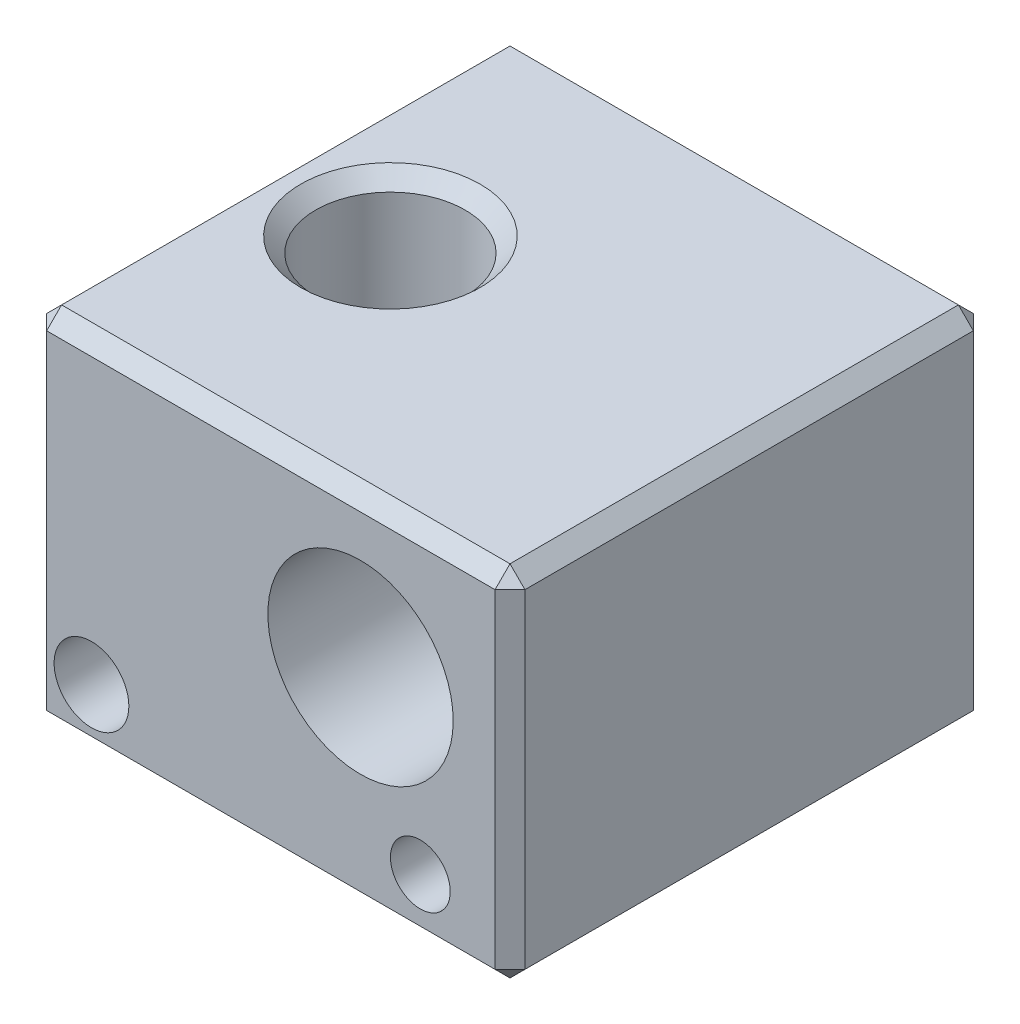
ISO-10303-21;
HEADER;
FILE_DESCRIPTION(('STEP AP214'),'2;1');
FILE_NAME('part.step','',(''),(''),'','','');
FILE_SCHEMA(('AUTOMOTIVE_DESIGN { 1 0 10303 214 1 1 1 1 }'));
ENDSEC;
DATA;
#1=APPLICATION_CONTEXT('core data for automotive mechanical design processes');
#2=APPLICATION_PROTOCOL_DEFINITION('international standard','automotive_design',2000,#1);
#3=PRODUCT_CONTEXT('',#1,'mechanical');
#4=PRODUCT('Part','Part','',(#3));
#5=PRODUCT_RELATED_PRODUCT_CATEGORY('part','',(#4));
#6=PRODUCT_DEFINITION_FORMATION('','',#4);
#7=PRODUCT_DEFINITION_CONTEXT('part definition',#1,'design');
#8=PRODUCT_DEFINITION('design','',#6,#7);
#9=PRODUCT_DEFINITION_SHAPE('','',#8);
#10=(LENGTH_UNIT() NAMED_UNIT(*) SI_UNIT(.MILLI.,.METRE.));
#11=(NAMED_UNIT(*) PLANE_ANGLE_UNIT() SI_UNIT($,.RADIAN.));
#12=(NAMED_UNIT(*) SI_UNIT($,.STERADIAN.) SOLID_ANGLE_UNIT());
#13=UNCERTAINTY_MEASURE_WITH_UNIT(LENGTH_MEASURE(1.E-05),#10,'distance_accuracy_value','');
#14=(GEOMETRIC_REPRESENTATION_CONTEXT(3) GLOBAL_UNCERTAINTY_ASSIGNED_CONTEXT((#13)) GLOBAL_UNIT_ASSIGNED_CONTEXT((#10,
#11,#12)) REPRESENTATION_CONTEXT('',''));
#15=CARTESIAN_POINT('',(0.,0.,0.));
#16=DIRECTION('',(0.,0.,1.));
#17=DIRECTION('',(1.,0.,0.));
#18=AXIS2_PLACEMENT_3D('',#15,#16,#17);
#19=CARTESIAN_POINT('',(-8.,12.,8.));
#20=DIRECTION('',(0.,0.,-1.));
#21=DIRECTION('',(-1.,0.,0.));
#22=AXIS2_PLACEMENT_3D('',#19,#20,#21);
#23=PLANE('',#22);
#24=DIRECTION('',(0.,-1.,0.));
#25=VECTOR('',#24,1.);
#26=CARTESIAN_POINT('',(-7.49999999999999,0.,8.));
#27=LINE('',#26,#25);
#28=CARTESIAN_POINT('',(-7.49999999999999,11.5,8.));
#29=VERTEX_POINT('',#28);
#30=CARTESIAN_POINT('',(-7.49999999999999,0.500000000000004,8.));
#31=VERTEX_POINT('',#30);
#32=EDGE_CURVE('E356',#29,#31,#27,.T.);
#33=ORIENTED_EDGE('',*,*,#32,.T.);
#34=DIRECTION('',(1.,0.,0.));
#35=VECTOR('',#34,1.);
#36=CARTESIAN_POINT('',(-8.,0.500000000000004,8.));
#37=LINE('',#36,#35);
#38=CARTESIAN_POINT('',(7.5,0.500000000000004,8.));
#39=VERTEX_POINT('',#38);
#40=EDGE_CURVE('E364',#31,#39,#37,.T.);
#41=ORIENTED_EDGE('',*,*,#40,.T.);
#42=DIRECTION('',(0.,1.,0.));
#43=VECTOR('',#42,1.);
#44=CARTESIAN_POINT('',(7.5,12.,8.));
#45=LINE('',#44,#43);
#46=CARTESIAN_POINT('',(7.5,11.5,8.));
#47=VERTEX_POINT('',#46);
#48=EDGE_CURVE('E346',#39,#47,#45,.T.);
#49=ORIENTED_EDGE('',*,*,#48,.T.);
#50=DIRECTION('',(-1.,0.,0.));
#51=VECTOR('',#50,1.);
#52=CARTESIAN_POINT('',(-8.,11.5,8.));
#53=LINE('',#52,#51);
#54=EDGE_CURVE('E352',#47,#29,#53,.T.);
#55=ORIENTED_EDGE('',*,*,#54,.T.);
#56=EDGE_LOOP('',(#33,#41,#49,#55));
#57=FACE_BOUND('',#56,.T.);
#58=CARTESIAN_POINT('',(-6.,2.,8.));
#59=DIRECTION('',(0.,0.,1.));
#60=DIRECTION('',(1.,0.,0.));
#61=AXIS2_PLACEMENT_3D('',#58,#59,#60);
#62=CIRCLE('',#61,1.25);
#63=CARTESIAN_POINT('',(-4.75,2.,8.));
#64=VERTEX_POINT('',#63);
#65=EDGE_CURVE('E223',#64,#64,#62,.T.);
#66=ORIENTED_EDGE('',*,*,#65,.F.);
#67=EDGE_LOOP('',(#66));
#68=FACE_BOUND('',#67,.T.);
#69=CARTESIAN_POINT('',(5.,2.,8.));
#70=DIRECTION('',(0.,0.,1.));
#71=DIRECTION('',(1.,0.,0.));
#72=AXIS2_PLACEMENT_3D('',#69,#70,#71);
#73=CIRCLE('',#72,1.);
#74=CARTESIAN_POINT('',(6.,2.,8.));
#75=VERTEX_POINT('',#74);
#76=EDGE_CURVE('E421',#75,#75,#73,.T.);
#77=ORIENTED_EDGE('',*,*,#76,.F.);
#78=EDGE_LOOP('',(#77));
#79=FACE_BOUND('',#78,.T.);
#80=CARTESIAN_POINT('',(3.,7.,8.));
#81=DIRECTION('',(0.,0.,1.));
#82=DIRECTION('',(1.,0.,0.));
#83=AXIS2_PLACEMENT_3D('',#80,#81,#82);
#84=CIRCLE('',#83,3.1);
#85=CARTESIAN_POINT('',(6.1,7.,8.));
#86=VERTEX_POINT('',#85);
#87=EDGE_CURVE('E415',#86,#86,#84,.T.);
#88=ORIENTED_EDGE('',*,*,#87,.F.);
#89=EDGE_LOOP('',(#88));
#90=FACE_BOUND('',#89,.T.);
#91=ADVANCED_FACE('F34',(#57,#68,#79,#90),#23,.F.);
#92=CARTESIAN_POINT('',(8.,12.,8.));
#93=DIRECTION('',(-1.,0.,0.));
#94=DIRECTION('',(0.,0.,1.));
#95=AXIS2_PLACEMENT_3D('',#92,#93,#94);
#96=PLANE('',#95);
#97=DIRECTION('',(0.,0.,1.));
#98=VECTOR('',#97,1.);
#99=CARTESIAN_POINT('',(8.,11.5,8.));
#100=LINE('',#99,#98);
#101=CARTESIAN_POINT('',(8.,11.5,-7.5));
#102=VERTEX_POINT('',#101);
#103=CARTESIAN_POINT('',(8.,11.5,7.5));
#104=VERTEX_POINT('',#103);
#105=EDGE_CURVE('E366',#102,#104,#100,.T.);
#106=ORIENTED_EDGE('',*,*,#105,.T.);
#107=DIRECTION('',(0.,-1.,0.));
#108=VECTOR('',#107,1.);
#109=CARTESIAN_POINT('',(8.,12.,7.5));
#110=LINE('',#109,#108);
#111=CARTESIAN_POINT('',(8.,0.5,7.5));
#112=VERTEX_POINT('',#111);
#113=EDGE_CURVE('E348',#104,#112,#110,.T.);
#114=ORIENTED_EDGE('',*,*,#113,.T.);
#115=DIRECTION('',(0.,0.,-1.));
#116=VECTOR('',#115,1.);
#117=CARTESIAN_POINT('',(8.,0.5,8.));
#118=LINE('',#117,#116);
#119=CARTESIAN_POINT('',(8.,0.5,-7.5));
#120=VERTEX_POINT('',#119);
#121=EDGE_CURVE('E370',#112,#120,#118,.T.);
#122=ORIENTED_EDGE('',*,*,#121,.T.);
#123=DIRECTION('',(0.,1.,0.));
#124=VECTOR('',#123,1.);
#125=CARTESIAN_POINT('',(8.,12.,-7.5));
#126=LINE('',#125,#124);
#127=EDGE_CURVE('E368',#120,#102,#126,.T.);
#128=ORIENTED_EDGE('',*,*,#127,.T.);
#129=EDGE_LOOP('',(#106,#114,#122,#128));
#130=FACE_BOUND('',#129,.T.);
#131=ADVANCED_FACE('F256',(#130),#96,.F.);
#132=CARTESIAN_POINT('',(-8.,12.,-8.));
#133=DIRECTION('',(0.,0.,-1.));
#134=DIRECTION('',(-1.,0.,0.));
#135=AXIS2_PLACEMENT_3D('',#132,#133,#134);
#136=PLANE('',#135);
#137=DIRECTION('',(-1.,0.,0.));
#138=VECTOR('',#137,1.);
#139=CARTESIAN_POINT('',(-8.,0.500000000000004,-8.));
#140=LINE('',#139,#138);
#141=CARTESIAN_POINT('',(7.5,0.500000000000004,-8.));
#142=VERTEX_POINT('',#141);
#143=CARTESIAN_POINT('',(-7.49999999999999,0.500000000000004,-8.));
#144=VERTEX_POINT('',#143);
#145=EDGE_CURVE('E359',#142,#144,#140,.T.);
#146=ORIENTED_EDGE('',*,*,#145,.T.);
#147=DIRECTION('',(0.,1.,0.));
#148=VECTOR('',#147,1.);
#149=CARTESIAN_POINT('',(-7.49999999999999,12.,-8.));
#150=LINE('',#149,#148);
#151=CARTESIAN_POINT('',(-7.49999999999999,11.5,-8.));
#152=VERTEX_POINT('',#151);
#153=EDGE_CURVE('E354',#144,#152,#150,.T.);
#154=ORIENTED_EDGE('',*,*,#153,.T.);
#155=DIRECTION('',(1.,0.,0.));
#156=VECTOR('',#155,1.);
#157=CARTESIAN_POINT('',(-8.,11.5,-8.));
#158=LINE('',#157,#156);
#159=CARTESIAN_POINT('',(7.5,11.5,-8.));
#160=VERTEX_POINT('',#159);
#161=EDGE_CURVE('E385',#152,#160,#158,.T.);
#162=ORIENTED_EDGE('',*,*,#161,.T.);
#163=DIRECTION('',(0.,-1.,0.));
#164=VECTOR('',#163,1.);
#165=CARTESIAN_POINT('',(7.5,0.,-8.));
#166=LINE('',#165,#164);
#167=EDGE_CURVE('E387',#160,#142,#166,.T.);
#168=ORIENTED_EDGE('',*,*,#167,.T.);
#169=EDGE_LOOP('',(#146,#154,#162,#168));
#170=FACE_BOUND('',#169,.T.);
#171=CARTESIAN_POINT('',(5.,2.,-8.));
#172=DIRECTION('',(0.,0.,1.));
#173=DIRECTION('',(1.,0.,0.));
#174=AXIS2_PLACEMENT_3D('',#171,#172,#173);
#175=CIRCLE('',#174,1.);
#176=CARTESIAN_POINT('',(6.,2.,-8.));
#177=VERTEX_POINT('',#176);
#178=EDGE_CURVE('E418',#177,#177,#175,.T.);
#179=ORIENTED_EDGE('',*,*,#178,.T.);
#180=EDGE_LOOP('',(#179));
#181=FACE_BOUND('',#180,.T.);
#182=CARTESIAN_POINT('',(3.,7.,-8.));
#183=DIRECTION('',(0.,0.,1.));
#184=DIRECTION('',(1.,0.,0.));
#185=AXIS2_PLACEMENT_3D('',#182,#183,#184);
#186=CIRCLE('',#185,3.1);
#187=CARTESIAN_POINT('',(6.1,7.,-8.));
#188=VERTEX_POINT('',#187);
#189=EDGE_CURVE('E144',#188,#188,#186,.T.);
#190=ORIENTED_EDGE('',*,*,#189,.T.);
#191=EDGE_LOOP('',(#190));
#192=FACE_BOUND('',#191,.T.);
#193=ADVANCED_FACE('F262',(#170,#181,#192),#136,.T.);
#194=CARTESIAN_POINT('',(-8.,12.,8.));
#195=DIRECTION('',(-1.,0.,0.));
#196=DIRECTION('',(0.,0.,1.));
#197=AXIS2_PLACEMENT_3D('',#194,#195,#196);
#198=PLANE('',#197);
#199=DIRECTION('',(0.,-1.,0.));
#200=VECTOR('',#199,1.);
#201=CARTESIAN_POINT('',(-8.,12.,-7.5));
#202=LINE('',#201,#200);
#203=CARTESIAN_POINT('',(-8.,11.5,-7.5));
#204=VERTEX_POINT('',#203);
#205=CARTESIAN_POINT('',(-8.,0.500000000000004,-7.5));
#206=VERTEX_POINT('',#205);
#207=EDGE_CURVE('E380',#204,#206,#202,.T.);
#208=ORIENTED_EDGE('',*,*,#207,.T.);
#209=DIRECTION('',(0.,0.,1.));
#210=VECTOR('',#209,1.);
#211=CARTESIAN_POINT('',(-8.,0.500000000000004,8.));
#212=LINE('',#211,#210);
#213=CARTESIAN_POINT('',(-8.,0.500000000000004,7.5));
#214=VERTEX_POINT('',#213);
#215=EDGE_CURVE('E150',#206,#214,#212,.T.);
#216=ORIENTED_EDGE('',*,*,#215,.T.);
#217=DIRECTION('',(0.,1.,0.));
#218=VECTOR('',#217,1.);
#219=CARTESIAN_POINT('',(-8.,12.,7.5));
#220=LINE('',#219,#218);
#221=CARTESIAN_POINT('',(-8.,11.5,7.5));
#222=VERTEX_POINT('',#221);
#223=EDGE_CURVE('E394',#214,#222,#220,.T.);
#224=ORIENTED_EDGE('',*,*,#223,.T.);
#225=DIRECTION('',(0.,0.,-1.));
#226=VECTOR('',#225,1.);
#227=CARTESIAN_POINT('',(-8.,11.5,8.));
#228=LINE('',#227,#226);
#229=EDGE_CURVE('E396',#222,#204,#228,.T.);
#230=ORIENTED_EDGE('',*,*,#229,.T.);
#231=EDGE_LOOP('',(#208,#216,#224,#230));
#232=FACE_BOUND('',#231,.T.);
#233=ADVANCED_FACE('F456',(#232),#198,.T.);
#234=CARTESIAN_POINT('',(0.,12.,0.));
#235=DIRECTION('',(0.,1.,0.));
#236=DIRECTION('',(0.,0.,1.));
#237=AXIS2_PLACEMENT_3D('',#234,#235,#236);
#238=PLANE('',#237);
#239=DIRECTION('',(-1.,0.,0.));
#240=VECTOR('',#239,1.);
#241=CARTESIAN_POINT('',(0.,12.,-7.5));
#242=LINE('',#241,#240);
#243=CARTESIAN_POINT('',(7.5,12.,-7.5));
#244=VERTEX_POINT('',#243);
#245=CARTESIAN_POINT('',(-7.5,12.,-7.5));
#246=VERTEX_POINT('',#245);
#247=EDGE_CURVE('E43',#244,#246,#242,.T.);
#248=ORIENTED_EDGE('',*,*,#247,.T.);
#249=DIRECTION('',(0.,0.,1.));
#250=VECTOR('',#249,1.);
#251=CARTESIAN_POINT('',(-7.5,12.,0.));
#252=LINE('',#251,#250);
#253=CARTESIAN_POINT('',(-7.5,12.,7.5));
#254=VERTEX_POINT('',#253);
#255=EDGE_CURVE('E11',#246,#254,#252,.T.);
#256=ORIENTED_EDGE('',*,*,#255,.T.);
#257=DIRECTION('',(1.,0.,0.));
#258=VECTOR('',#257,1.);
#259=CARTESIAN_POINT('',(8.,12.,7.5));
#260=LINE('',#259,#258);
#261=CARTESIAN_POINT('',(7.5,12.,7.5));
#262=VERTEX_POINT('',#261);
#263=EDGE_CURVE('E376',#254,#262,#260,.T.);
#264=ORIENTED_EDGE('',*,*,#263,.T.);
#265=DIRECTION('',(0.,0.,-1.));
#266=VECTOR('',#265,1.);
#267=CARTESIAN_POINT('',(7.5,12.,-8.));
#268=LINE('',#267,#266);
#269=EDGE_CURVE('E54',#262,#244,#268,.T.);
#270=ORIENTED_EDGE('',*,*,#269,.T.);
#271=EDGE_LOOP('',(#248,#256,#264,#270));
#272=FACE_BOUND('',#271,.T.);
#273=CARTESIAN_POINT('',(-4.,12.,0.));
#274=DIRECTION('',(0.,1.,0.));
#275=DIRECTION('',(0.,0.,1.));
#276=AXIS2_PLACEMENT_3D('',#273,#274,#275);
#277=CIRCLE('',#276,2.99999999999999);
#278=CARTESIAN_POINT('',(-4.,12.,2.99999999999999));
#279=VERTEX_POINT('',#278);
#280=EDGE_CURVE('E373',#279,#279,#277,.F.);
#281=ORIENTED_EDGE('',*,*,#280,.T.);
#282=EDGE_LOOP('',(#281));
#283=FACE_BOUND('',#282,.T.);
#284=ADVANCED_FACE('F449',(#272,#283),#238,.T.);
#285=CARTESIAN_POINT('',(0.,0.,0.));
#286=DIRECTION('',(0.,1.,0.));
#287=DIRECTION('',(0.,0.,1.));
#288=AXIS2_PLACEMENT_3D('',#285,#286,#287);
#289=PLANE('',#288);
#290=CARTESIAN_POINT('',(-4.,0.,0.));
#291=DIRECTION('',(0.,1.,0.));
#292=DIRECTION('',(0.,0.,1.));
#293=AXIS2_PLACEMENT_3D('',#290,#291,#292);
#294=CIRCLE('',#293,3.);
#295=CARTESIAN_POINT('',(-4.,0.,3.));
#296=VERTEX_POINT('',#295);
#297=EDGE_CURVE('E406',#296,#296,#294,.T.);
#298=ORIENTED_EDGE('',*,*,#297,.T.);
#299=EDGE_LOOP('',(#298));
#300=FACE_BOUND('',#299,.T.);
#301=CARTESIAN_POINT('',(2.,0.,0.));
#302=DIRECTION('',(0.,1.,0.));
#303=DIRECTION('',(0.,0.,1.));
#304=AXIS2_PLACEMENT_3D('',#301,#302,#303);
#305=CIRCLE('',#304,1.75);
#306=CARTESIAN_POINT('',(2.,0.,1.75));
#307=VERTEX_POINT('',#306);
#308=EDGE_CURVE('E409',#307,#307,#305,.T.);
#309=ORIENTED_EDGE('',*,*,#308,.T.);
#310=EDGE_LOOP('',(#309));
#311=FACE_BOUND('',#310,.T.);
#312=DIRECTION('',(1.,0.,0.));
#313=VECTOR('',#312,1.);
#314=CARTESIAN_POINT('',(8.,0.,-7.5));
#315=LINE('',#314,#313);
#316=CARTESIAN_POINT('',(-7.5,0.,-7.5));
#317=VERTEX_POINT('',#316);
#318=CARTESIAN_POINT('',(7.5,0.,-7.5));
#319=VERTEX_POINT('',#318);
#320=EDGE_CURVE('E126',#317,#319,#315,.T.);
#321=ORIENTED_EDGE('',*,*,#320,.T.);
#322=DIRECTION('',(0.,0.,1.));
#323=VECTOR('',#322,1.);
#324=CARTESIAN_POINT('',(7.5,0.,0.));
#325=LINE('',#324,#323);
#326=CARTESIAN_POINT('',(7.5,0.,7.5));
#327=VERTEX_POINT('',#326);
#328=EDGE_CURVE('E412',#319,#327,#325,.T.);
#329=ORIENTED_EDGE('',*,*,#328,.T.);
#330=DIRECTION('',(-1.,0.,0.));
#331=VECTOR('',#330,1.);
#332=CARTESIAN_POINT('',(0.,0.,7.5));
#333=LINE('',#332,#331);
#334=CARTESIAN_POINT('',(-7.5,0.,7.5));
#335=VERTEX_POINT('',#334);
#336=EDGE_CURVE('E128',#327,#335,#333,.T.);
#337=ORIENTED_EDGE('',*,*,#336,.T.);
#338=DIRECTION('',(0.,0.,-1.));
#339=VECTOR('',#338,1.);
#340=CARTESIAN_POINT('',(-7.5,0.,-8.));
#341=LINE('',#340,#339);
#342=EDGE_CURVE('E122',#335,#317,#341,.T.);
#343=ORIENTED_EDGE('',*,*,#342,.T.);
#344=EDGE_LOOP('',(#321,#329,#337,#343));
#345=FACE_BOUND('',#344,.T.);
#346=ADVANCED_FACE('F124',(#300,#311,#345),#289,.F.);
#347=CARTESIAN_POINT('',(3.,7.,-8.));
#348=DIRECTION('',(0.,0.,1.));
#349=DIRECTION('',(1.,0.,0.));
#350=AXIS2_PLACEMENT_3D('',#347,#348,#349);
#351=CYLINDRICAL_SURFACE('',#350,3.1);
#352=CARTESIAN_POINT('',(2.,4.06571984977576,-1.25));
#353=CARTESIAN_POINT('',(2.06412407102761,4.04386931657047,-1.24999682356544));
#354=CARTESIAN_POINT('',(2.1290323605544,4.02411324985325,-1.24504633684303));
#355=CARTESIAN_POINT('',(2.25852514450525,3.98923249124023,-1.22473081712279));
#356=CARTESIAN_POINT('',(2.32310928391037,3.97411209996811,-1.20935615557821));
#357=CARTESIAN_POINT('',(2.44989951240688,3.94851243111399,-1.16813357100094));
#358=CARTESIAN_POINT('',(2.5121031224863,3.93803787752112,-1.14227503862974));
#359=CARTESIAN_POINT('',(2.63195571275444,3.92132984840443,-1.08059009030169));
#360=CARTESIAN_POINT('',(2.68960522979696,3.9150958723238,-1.04476485151625));
#361=CARTESIAN_POINT('',(2.79749646548957,3.9061553785297,-0.964844569883464));
#362=CARTESIAN_POINT('',(2.84785468706466,3.90338624247298,-0.920913307988026));
#363=CARTESIAN_POINT('',(2.94096515404917,3.9002113379841,-0.825546991201818));
#364=CARTESIAN_POINT('',(2.98371611790489,3.89980596739803,-0.77411067462625));
#365=CARTESIAN_POINT('',(3.06159260293196,3.90035946609992,-0.663497060760644));
#366=CARTESIAN_POINT('',(3.09645925371717,3.90135848340574,-0.604137697597038));
#367=CARTESIAN_POINT('',(3.15599100394901,3.90378325578923,-0.48051332323618));
#368=CARTESIAN_POINT('',(3.18065507855612,3.90520905371185,-0.41624781998927));
#369=CARTESIAN_POINT('',(3.219563460487,3.90772172802315,-0.283004227305716));
#370=CARTESIAN_POINT('',(3.23355335949016,3.90879999521813,-0.213951486933704));
#371=CARTESIAN_POINT('',(3.24975342466547,3.91006624436077,-0.0744708002820152));
#372=CARTESIAN_POINT('',(3.25196372633312,3.91025423654886,-0.0040428698298939));
#373=CARTESIAN_POINT('',(3.24454584579713,3.90965852729883,0.13610331981758));
#374=CARTESIAN_POINT('',(3.23493084752302,3.90887590797932,0.205822282120605));
#375=CARTESIAN_POINT('',(3.20416096316388,3.90669215451381,0.342658473349358));
#376=CARTESIAN_POINT('',(3.18300525336871,3.90529097621996,0.409775516198639));
#377=CARTESIAN_POINT('',(3.12971705925274,3.90260076032698,0.539600864597366));
#378=CARTESIAN_POINT('',(3.09757104261829,3.90131186344619,0.602303619527018));
#379=CARTESIAN_POINT('',(3.02320544748315,3.89986461575388,0.721443742705734));
#380=CARTESIAN_POINT('',(2.98098576274907,3.89970627686539,0.777881044872323));
#381=CARTESIAN_POINT('',(2.88783342606414,3.90168164861602,0.882695629692789));
#382=CARTESIAN_POINT('',(2.83692789470841,3.90380833082803,0.931097102225148));
#383=CARTESIAN_POINT('',(2.72789903274865,3.91148275042813,1.01859946114047));
#384=CARTESIAN_POINT('',(2.6697779427384,3.91702942794207,1.0577032237314));
#385=CARTESIAN_POINT('',(2.55012644860688,3.93224260272356,1.12446031488305));
#386=CARTESIAN_POINT('',(2.48875355593523,3.9417786318946,1.15242580114432));
#387=CARTESIAN_POINT('',(2.36312125667163,3.96545446304068,1.19795912574914));
#388=CARTESIAN_POINT('',(2.29886232190712,3.97959351483077,1.21552865707629));
#389=CARTESIAN_POINT('',(2.17069358533456,4.01226682493206,1.23997912488614));
#390=CARTESIAN_POINT('',(2.10679724119453,4.03072012533362,1.24704113706527));
#391=CARTESIAN_POINT('',(1.98004597127627,4.07183711455998,1.25145005951004));
#392=CARTESIAN_POINT('',(1.91719133547124,4.09450195497261,1.24879430886528));
#393=CARTESIAN_POINT('',(1.79039996352613,4.14486637335437,1.23404889696496));
#394=CARTESIAN_POINT('',(1.72661340015781,4.17278229677925,1.22141881599695));
#395=CARTESIAN_POINT('',(1.60309462789989,4.23172480365729,1.18704722608764));
#396=CARTESIAN_POINT('',(1.54336344063695,4.26275216610093,1.16530343105146));
#397=CARTESIAN_POINT('',(1.42117063361051,4.33113821293562,1.11019217671031));
#398=CARTESIAN_POINT('',(1.35939678232038,4.36879094402457,1.07566592104613));
#399=CARTESIAN_POINT('',(1.24282899693574,4.4451575339971,0.997068324896723));
#400=CARTESIAN_POINT('',(1.18804788503108,4.48387318839118,0.952979839015347));
#401=CARTESIAN_POINT('',(1.07981131798573,4.5652493581044,0.84973208913941));
#402=CARTESIAN_POINT('',(1.02740262887541,4.60778841664885,0.78937125648153));
#403=CARTESIAN_POINT('',(0.933940511899614,4.68803781259185,0.657652699139252));
#404=CARTESIAN_POINT('',(0.892858403867074,4.72576021366949,0.58632347533955));
#405=CARTESIAN_POINT('',(0.837584924562768,4.77855333774515,0.462557639917995));
#406=CARTESIAN_POINT('',(0.819123133548135,4.79676287087563,0.413367344271981));
#407=CARTESIAN_POINT('',(0.78826980528795,4.82773679133903,0.311499179493662));
#408=CARTESIAN_POINT('',(0.77586854424242,4.84050989685295,0.25882705197902));
#409=CARTESIAN_POINT('',(0.757881546309418,4.85918640303962,0.150576807086338));
#410=CARTESIAN_POINT('',(0.752359461653582,4.86502562241385,0.0949764403431551));
#411=CARTESIAN_POINT('',(0.748865472828148,4.86870869109976,-0.0167257193774438));
#412=CARTESIAN_POINT('',(0.75089069399976,4.86655558457313,-0.0728273133239362));
#413=CARTESIAN_POINT('',(0.761578516592351,4.85535245667867,-0.176640207564639));
#414=CARTESIAN_POINT('',(0.769401951034631,4.84717513891782,-0.224540654398175));
#415=CARTESIAN_POINT('',(0.790189830408191,4.82584267352125,-0.318052868932751));
#416=CARTESIAN_POINT('',(0.803158016152508,4.81268390412906,-0.363662944029742));
#417=CARTESIAN_POINT('',(0.840162649243759,4.77603236941032,-0.470880626168048));
#418=CARTESIAN_POINT('',(0.866560750198721,4.75052707780665,-0.530981431141114));
#419=CARTESIAN_POINT('',(0.927112096806266,4.69460608468315,-0.644654810619277));
#420=CARTESIAN_POINT('',(0.96128358816086,4.66417887978581,-0.698211562882469));
#421=CARTESIAN_POINT('',(1.04663268271053,4.59204167799534,-0.812383187083013));
#422=CARTESIAN_POINT('',(1.09990535564506,4.54952185264107,-0.870922323350582));
#423=CARTESIAN_POINT('',(1.21609478271498,4.46368107503741,-0.976818044097293));
#424=CARTESIAN_POINT('',(1.27901991633881,4.42035945574847,-1.02416482064182));
#425=CARTESIAN_POINT('',(1.41392776615344,4.33527163579194,-1.10694157287936));
#426=CARTESIAN_POINT('',(1.48596282556899,4.29351639302137,-1.14229794759976));
#427=CARTESIAN_POINT('',(1.63734346211578,4.21424966883542,-1.19894283194074));
#428=CARTESIAN_POINT('',(1.71666261513442,4.17672386857871,-1.22028006615794));
#429=CARTESIAN_POINT('',(1.83136793930619,4.12848715119251,-1.23902278442863));
#430=CARTESIAN_POINT('',(1.86466000756247,4.11516072866024,-1.2431091379948));
#431=CARTESIAN_POINT('',(1.93189370742814,4.08959773467645,-1.24859903306798));
#432=CARTESIAN_POINT('',(1.96583554893592,4.07736152287063,-1.25000169236203));
#433=CARTESIAN_POINT('',(2.,4.06571984977576,-1.25));
#434=B_SPLINE_CURVE_WITH_KNOTS('',3,(#352,#353,#354,#355,#356,#357,#358,#359,#360,#361,#362,
#363,#364,#365,#366,#367,#368,#369,#370,#371,#372,#373,#374,#375,#376,#377,#378,#379,#380,#381,
#382,#383,#384,#385,#386,#387,#388,#389,#390,#391,#392,#393,#394,#395,#396,#397,#398,#399,#400,
#401,#402,#403,#404,#405,#406,#407,#408,#409,#410,#411,#412,#413,#414,#415,#416,#417,#418,#419,
#420,#421,#422,#423,#424,#425,#426,#427,#428,#429,#430,#431,#432,#433),.UNSPECIFIED.,.T.,.F.,(4,
2,2,2,2,2,2,2,2,2,2,2,2,2,2,2,2,2,2,2,2,2,2,2,2,2,2,2,2,2,2,2,2,2,2,2,2,2,2,2,4),(0.,
0.203106901637013,0.406401664025732,0.609902669700279,0.813379649991945,1.01312353075626,
1.21290102950349,1.41850722043965,1.62413405931888,1.83452067354489,2.04490486778157,
2.25505471888995,2.46521957125866,2.67564413620872,2.88607092032087,3.09585230705912,
3.30556871411916,3.50890505804192,3.71220827947522,3.91196568210335,4.11177778624364,
4.32322687709546,4.53472903986192,4.77426968848165,5.01424344552382,5.28461256836008,
5.55429066399378,5.72053905381196,5.88651982393155,6.05402525513779,6.22146689248854,
6.36849795003851,6.51563611222958,6.72574116876292,6.93634456763189,7.20454767246493,
7.47298494124712,7.74304134015153,8.01215410127126,8.120331198527,8.2285438508205),.UNSPECIFIED.);
#435=CARTESIAN_POINT('',(2.,4.06571984977576,-1.25));
#436=VERTEX_POINT('',#435);
#437=EDGE_CURVE('E217',#436,#436,#434,.T.);
#438=ORIENTED_EDGE('',*,*,#437,.T.);
#439=EDGE_LOOP('',(#438));
#440=FACE_BOUND('',#439,.T.);
#441=ORIENTED_EDGE('',*,*,#189,.F.);
#442=EDGE_LOOP('',(#441));
#443=FACE_BOUND('',#442,.T.);
#444=ORIENTED_EDGE('',*,*,#87,.T.);
#445=EDGE_LOOP('',(#444));
#446=FACE_BOUND('',#445,.T.);
#447=ADVANCED_FACE('F439',(#440,#443,#446),#351,.F.);
#448=CARTESIAN_POINT('',(5.,2.,-8.));
#449=DIRECTION('',(0.,0.,1.));
#450=DIRECTION('',(1.,0.,0.));
#451=AXIS2_PLACEMENT_3D('',#448,#449,#450);
#452=CYLINDRICAL_SURFACE('',#451,1.);
#453=ORIENTED_EDGE('',*,*,#178,.F.);
#454=EDGE_LOOP('',(#453));
#455=FACE_BOUND('',#454,.T.);
#456=ORIENTED_EDGE('',*,*,#76,.T.);
#457=EDGE_LOOP('',(#456));
#458=FACE_BOUND('',#457,.T.);
#459=ADVANCED_FACE('F441',(#455,#458),#452,.F.);
#460=CARTESIAN_POINT('',(-6.,2.,3.5));
#461=DIRECTION('',(0.,0.,-1.));
#462=DIRECTION('',(-1.,0.,0.));
#463=AXIS2_PLACEMENT_3D('',#460,#461,#462);
#464=PLANE('',#463);
#465=CARTESIAN_POINT('',(-6.,2.,3.5));
#466=DIRECTION('',(0.,0.,1.));
#467=DIRECTION('',(1.,0.,0.));
#468=AXIS2_PLACEMENT_3D('',#465,#466,#467);
#469=CIRCLE('',#468,1.25);
#470=CARTESIAN_POINT('',(-4.75,2.,3.5));
#471=VERTEX_POINT('',#470);
#472=EDGE_CURVE('E228',#471,#471,#469,.T.);
#473=ORIENTED_EDGE('',*,*,#472,.T.);
#474=EDGE_LOOP('',(#473));
#475=FACE_BOUND('',#474,.T.);
#476=ADVANCED_FACE('F428',(#475),#464,.F.);
#477=CARTESIAN_POINT('',(-6.,2.,8.));
#478=DIRECTION('',(0.,0.,1.));
#479=DIRECTION('',(1.,0.,0.));
#480=AXIS2_PLACEMENT_3D('',#477,#478,#479);
#481=CYLINDRICAL_SURFACE('',#480,1.25);
#482=ORIENTED_EDGE('',*,*,#472,.F.);
#483=EDGE_LOOP('',(#482));
#484=FACE_BOUND('',#483,.T.);
#485=ORIENTED_EDGE('',*,*,#65,.T.);
#486=EDGE_LOOP('',(#485));
#487=FACE_BOUND('',#486,.T.);
#488=ADVANCED_FACE('F251',(#484,#487),#481,.F.);
#489=CARTESIAN_POINT('',(-4.,12.,0.));
#490=DIRECTION('',(0.,1.,0.));
#491=DIRECTION('',(0.,0.,1.));
#492=AXIS2_PLACEMENT_3D('',#489,#490,#491);
#493=CYLINDRICAL_SURFACE('',#492,2.49999999999999);
#494=CARTESIAN_POINT('',(-4.,0.500000000000007,0.));
#495=DIRECTION('',(0.,1.,0.));
#496=DIRECTION('',(0.,0.,1.));
#497=AXIS2_PLACEMENT_3D('',#494,#495,#496);
#498=CIRCLE('',#497,2.49999999999999);
#499=CARTESIAN_POINT('',(-4.,0.500000000000007,2.49999999999999));
#500=VERTEX_POINT('',#499);
#501=EDGE_CURVE('E400',#500,#500,#498,.F.);
#502=ORIENTED_EDGE('',*,*,#501,.T.);
#503=EDGE_LOOP('',(#502));
#504=FACE_BOUND('',#503,.T.);
#505=CARTESIAN_POINT('',(-4.,11.5,0.));
#506=DIRECTION('',(0.,1.,0.));
#507=DIRECTION('',(0.,0.,1.));
#508=AXIS2_PLACEMENT_3D('',#505,#506,#507);
#509=CIRCLE('',#508,2.49999999999999);
#510=CARTESIAN_POINT('',(-4.,11.5,2.49999999999999));
#511=VERTEX_POINT('',#510);
#512=EDGE_CURVE('E403',#511,#511,#509,.T.);
#513=ORIENTED_EDGE('',*,*,#512,.T.);
#514=EDGE_LOOP('',(#513));
#515=FACE_BOUND('',#514,.T.);
#516=ADVANCED_FACE('F242',(#504,#515),#493,.F.);
#517=CARTESIAN_POINT('',(2.,0.,0.));
#518=DIRECTION('',(0.,-1.,0.));
#519=DIRECTION('',(0.,0.,-1.));
#520=AXIS2_PLACEMENT_3D('',#517,#518,#519);
#521=CYLINDRICAL_SURFACE('',#520,1.25);
#522=CARTESIAN_POINT('',(2.,0.499999999999996,0.));
#523=DIRECTION('',(0.,1.,0.));
#524=DIRECTION('',(0.,0.,1.));
#525=AXIS2_PLACEMENT_3D('',#522,#523,#524);
#526=CIRCLE('',#525,1.25);
#527=CARTESIAN_POINT('',(2.,0.499999999999996,1.25));
#528=VERTEX_POINT('',#527);
#529=EDGE_CURVE('E398',#528,#528,#526,.F.);
#530=ORIENTED_EDGE('',*,*,#529,.T.);
#531=EDGE_LOOP('',(#530));
#532=FACE_BOUND('',#531,.T.);
#533=ORIENTED_EDGE('',*,*,#437,.F.);
#534=EDGE_LOOP('',(#533));
#535=FACE_BOUND('',#534,.T.);
#536=ADVANCED_FACE('F238',(#532,#535),#521,.F.);
#537=CARTESIAN_POINT('',(-4.,0.,0.));
#538=DIRECTION('',(0.,-1.,0.));
#539=DIRECTION('',(0.,0.,-1.));
#540=AXIS2_PLACEMENT_3D('',#537,#538,#539);
#541=CONICAL_SURFACE('',#540,3.,0.785398163397445);
#542=ORIENTED_EDGE('',*,*,#501,.F.);
#543=EDGE_LOOP('',(#542));
#544=FACE_BOUND('',#543,.T.);
#545=ORIENTED_EDGE('',*,*,#297,.F.);
#546=EDGE_LOOP('',(#545));
#547=FACE_BOUND('',#546,.T.);
#548=ADVANCED_FACE('F241',(#544,#547),#541,.F.);
#549=CARTESIAN_POINT('',(2.,0.499999999999996,0.));
#550=DIRECTION('',(0.,-1.,0.));
#551=DIRECTION('',(0.,0.,-1.));
#552=AXIS2_PLACEMENT_3D('',#549,#550,#551);
#553=CONICAL_SURFACE('',#552,1.25,0.785398163397451);
#554=ORIENTED_EDGE('',*,*,#308,.F.);
#555=EDGE_LOOP('',(#554));
#556=FACE_BOUND('',#555,.T.);
#557=ORIENTED_EDGE('',*,*,#529,.F.);
#558=EDGE_LOOP('',(#557));
#559=FACE_BOUND('',#558,.T.);
#560=ADVANCED_FACE('F248',(#556,#559),#553,.F.);
#561=CARTESIAN_POINT('',(8.,12.,7.5));
#562=DIRECTION('',(-0.707106781186545,0.,-0.70710678118655));
#563=DIRECTION('',(0.,-1.,0.));
#564=AXIS2_PLACEMENT_3D('',#561,#562,#563);
#565=PLANE('',#564);
#566=DIRECTION('',(-0.70710678118655,0.,0.707106781186545));
#567=VECTOR('',#566,1.);
#568=CARTESIAN_POINT('',(7.5,11.5,8.));
#569=LINE('',#568,#567);
#570=EDGE_CURVE('E38',#47,#104,#569,.F.);
#571=ORIENTED_EDGE('',*,*,#570,.F.);
#572=ORIENTED_EDGE('',*,*,#48,.F.);
#573=DIRECTION('',(0.70710678118655,0.,-0.707106781186545));
#574=VECTOR('',#573,1.);
#575=CARTESIAN_POINT('',(8.,0.5,7.5));
#576=LINE('',#575,#574);
#577=EDGE_CURVE('E210',#112,#39,#576,.F.);
#578=ORIENTED_EDGE('',*,*,#577,.F.);
#579=ORIENTED_EDGE('',*,*,#113,.F.);
#580=EDGE_LOOP('',(#571,#572,#578,#579));
#581=FACE_BOUND('',#580,.T.);
#582=ADVANCED_FACE('F271',(#581),#565,.F.);
#583=CARTESIAN_POINT('',(7.5,11.5,8.));
#584=DIRECTION('',(0.577350269189626,0.577350269189622,0.57735026918963));
#585=DIRECTION('',(0.70710678118655,0.,-0.707106781186545));
#586=AXIS2_PLACEMENT_3D('',#583,#584,#585);
#587=PLANE('',#586);
#588=DIRECTION('',(0.,-0.70710678118655,0.707106781186545));
#589=VECTOR('',#588,1.);
#590=CARTESIAN_POINT('',(7.5,11.5,8.));
#591=LINE('',#590,#589);
#592=EDGE_CURVE('E205',#47,#262,#591,.F.);
#593=ORIENTED_EDGE('',*,*,#592,.F.);
#594=ORIENTED_EDGE('',*,*,#570,.T.);
#595=DIRECTION('',(-0.707106781186545,0.70710678118655,0.));
#596=VECTOR('',#595,1.);
#597=CARTESIAN_POINT('',(7.75,11.75,7.5));
#598=LINE('',#597,#596);
#599=EDGE_CURVE('E208',#262,#104,#598,.F.);
#600=ORIENTED_EDGE('',*,*,#599,.F.);
#601=EDGE_LOOP('',(#593,#594,#600));
#602=FACE_BOUND('',#601,.T.);
#603=ADVANCED_FACE('F338',(#602),#587,.T.);
#604=CARTESIAN_POINT('',(8.,0.5,7.5));
#605=DIRECTION('',(0.577350269189622,-0.577350269189626,0.57735026918963));
#606=DIRECTION('',(0.,-0.70710678118655,-0.707106781186545));
#607=AXIS2_PLACEMENT_3D('',#604,#605,#606);
#608=PLANE('',#607);
#609=DIRECTION('',(-0.70710678118655,-0.707106781186545,0.));
#610=VECTOR('',#609,1.);
#611=CARTESIAN_POINT('',(8.,0.5,7.5));
#612=LINE('',#611,#610);
#613=EDGE_CURVE('E199',#112,#327,#612,.T.);
#614=ORIENTED_EDGE('',*,*,#613,.F.);
#615=ORIENTED_EDGE('',*,*,#577,.T.);
#616=DIRECTION('',(0.,0.70710678118655,0.707106781186545));
#617=VECTOR('',#616,1.);
#618=CARTESIAN_POINT('',(7.5,0.250000000000002,7.75));
#619=LINE('',#618,#617);
#620=EDGE_CURVE('E202',#327,#39,#619,.T.);
#621=ORIENTED_EDGE('',*,*,#620,.F.);
#622=EDGE_LOOP('',(#614,#615,#621));
#623=FACE_BOUND('',#622,.T.);
#624=ADVANCED_FACE('F334',(#623),#608,.T.);
#625=CARTESIAN_POINT('',(7.5,12.,0.));
#626=DIRECTION('',(0.70710678118655,0.707106781186545,0.));
#627=DIRECTION('',(0.,0.,1.));
#628=AXIS2_PLACEMENT_3D('',#625,#626,#627);
#629=PLANE('',#628);
#630=ORIENTED_EDGE('',*,*,#599,.T.);
#631=ORIENTED_EDGE('',*,*,#105,.F.);
#632=DIRECTION('',(0.707106781186545,-0.70710678118655,0.));
#633=VECTOR('',#632,1.);
#634=CARTESIAN_POINT('',(8.,11.5,-7.5));
#635=LINE('',#634,#633);
#636=EDGE_CURVE('E193',#244,#102,#635,.T.);
#637=ORIENTED_EDGE('',*,*,#636,.F.);
#638=ORIENTED_EDGE('',*,*,#269,.F.);
#639=EDGE_LOOP('',(#630,#631,#637,#638));
#640=FACE_BOUND('',#639,.T.);
#641=ADVANCED_FACE('F330',(#640),#629,.T.);
#642=CARTESIAN_POINT('',(0.,12.,7.5));
#643=DIRECTION('',(0.,0.707106781186545,0.70710678118655));
#644=DIRECTION('',(-1.,0.,0.));
#645=AXIS2_PLACEMENT_3D('',#642,#643,#644);
#646=PLANE('',#645);
#647=ORIENTED_EDGE('',*,*,#592,.T.);
#648=ORIENTED_EDGE('',*,*,#263,.F.);
#649=DIRECTION('',(0.,0.70710678118655,-0.707106781186545));
#650=VECTOR('',#649,1.);
#651=CARTESIAN_POINT('',(-7.5,11.75,7.75));
#652=LINE('',#651,#650);
#653=EDGE_CURVE('E190',#29,#254,#652,.T.);
#654=ORIENTED_EDGE('',*,*,#653,.F.);
#655=ORIENTED_EDGE('',*,*,#54,.F.);
#656=EDGE_LOOP('',(#647,#648,#654,#655));
#657=FACE_BOUND('',#656,.T.);
#658=ADVANCED_FACE('F326',(#657),#646,.T.);
#659=CARTESIAN_POINT('',(-7.49999999999999,12.,8.));
#660=DIRECTION('',(-0.707106781186545,0.,0.70710678118655));
#661=DIRECTION('',(0.,1.,0.));
#662=AXIS2_PLACEMENT_3D('',#659,#660,#661);
#663=PLANE('',#662);
#664=DIRECTION('',(-0.70710678118655,0.,-0.707106781186545));
#665=VECTOR('',#664,1.);
#666=CARTESIAN_POINT('',(-7.49999999999999,0.500000000000004,8.));
#667=LINE('',#666,#665);
#668=EDGE_CURVE('E184',#31,#214,#667,.T.);
#669=ORIENTED_EDGE('',*,*,#668,.F.);
#670=ORIENTED_EDGE('',*,*,#32,.F.);
#671=DIRECTION('',(0.70710678118655,0.,0.707106781186545));
#672=VECTOR('',#671,1.);
#673=CARTESIAN_POINT('',(-8.,11.5,7.5));
#674=LINE('',#673,#672);
#675=EDGE_CURVE('E187',#222,#29,#674,.T.);
#676=ORIENTED_EDGE('',*,*,#675,.F.);
#677=ORIENTED_EDGE('',*,*,#223,.F.);
#678=EDGE_LOOP('',(#669,#670,#676,#677));
#679=FACE_BOUND('',#678,.T.);
#680=ADVANCED_FACE('F322',(#679),#663,.T.);
#681=CARTESIAN_POINT('',(-8.,0.500000000000004,8.));
#682=DIRECTION('',(0.,0.707106781186545,-0.70710678118655));
#683=DIRECTION('',(1.,0.,0.));
#684=AXIS2_PLACEMENT_3D('',#681,#682,#683);
#685=PLANE('',#684);
#686=ORIENTED_EDGE('',*,*,#620,.T.);
#687=ORIENTED_EDGE('',*,*,#40,.F.);
#688=DIRECTION('',(0.,-0.70710678118655,-0.707106781186545));
#689=VECTOR('',#688,1.);
#690=CARTESIAN_POINT('',(-7.49999999999999,0.500000000000004,8.));
#691=LINE('',#690,#689);
#692=EDGE_CURVE('E182',#335,#31,#691,.F.);
#693=ORIENTED_EDGE('',*,*,#692,.F.);
#694=ORIENTED_EDGE('',*,*,#336,.F.);
#695=EDGE_LOOP('',(#686,#687,#693,#694));
#696=FACE_BOUND('',#695,.T.);
#697=ADVANCED_FACE('F318',(#696),#685,.F.);
#698=CARTESIAN_POINT('',(8.,0.5,8.));
#699=DIRECTION('',(-0.707106781186545,0.70710678118655,0.));
#700=DIRECTION('',(0.,0.,-1.));
#701=AXIS2_PLACEMENT_3D('',#698,#699,#700);
#702=PLANE('',#701);
#703=ORIENTED_EDGE('',*,*,#613,.T.);
#704=ORIENTED_EDGE('',*,*,#328,.F.);
#705=DIRECTION('',(0.70710678118655,0.707106781186545,0.));
#706=VECTOR('',#705,1.);
#707=CARTESIAN_POINT('',(8.,0.5,-7.5));
#708=LINE('',#707,#706);
#709=EDGE_CURVE('E179',#120,#319,#708,.F.);
#710=ORIENTED_EDGE('',*,*,#709,.F.);
#711=ORIENTED_EDGE('',*,*,#121,.F.);
#712=EDGE_LOOP('',(#703,#704,#710,#711));
#713=FACE_BOUND('',#712,.T.);
#714=ADVANCED_FACE('F314',(#713),#702,.F.);
#715=CARTESIAN_POINT('',(7.5,12.,-8.));
#716=DIRECTION('',(0.70710678118655,0.,-0.707106781186545));
#717=DIRECTION('',(0.,1.,0.));
#718=AXIS2_PLACEMENT_3D('',#715,#716,#717);
#719=PLANE('',#718);
#720=DIRECTION('',(-0.707106781186545,0.,-0.70710678118655));
#721=VECTOR('',#720,1.);
#722=CARTESIAN_POINT('',(8.,11.5,-7.5));
#723=LINE('',#722,#721);
#724=EDGE_CURVE('E196',#102,#160,#723,.T.);
#725=ORIENTED_EDGE('',*,*,#724,.F.);
#726=ORIENTED_EDGE('',*,*,#127,.F.);
#727=DIRECTION('',(0.707106781186545,0.,0.70710678118655));
#728=VECTOR('',#727,1.);
#729=CARTESIAN_POINT('',(8.,0.5,-7.5));
#730=LINE('',#729,#728);
#731=EDGE_CURVE('E176',#142,#120,#730,.T.);
#732=ORIENTED_EDGE('',*,*,#731,.F.);
#733=ORIENTED_EDGE('',*,*,#167,.F.);
#734=EDGE_LOOP('',(#725,#726,#732,#733));
#735=FACE_BOUND('',#734,.T.);
#736=ADVANCED_FACE('F310',(#735),#719,.T.);
#737=CARTESIAN_POINT('',(8.,11.5,-7.5));
#738=DIRECTION('',(0.57735026918963,0.577350269189622,-0.577350269189626));
#739=DIRECTION('',(-0.707106781186545,0.,-0.70710678118655));
#740=AXIS2_PLACEMENT_3D('',#737,#738,#739);
#741=PLANE('',#740);
#742=ORIENTED_EDGE('',*,*,#636,.T.);
#743=ORIENTED_EDGE('',*,*,#724,.T.);
#744=DIRECTION('',(0.,-0.70710678118655,-0.707106781186545));
#745=VECTOR('',#744,1.);
#746=CARTESIAN_POINT('',(7.5,11.75,-7.75));
#747=LINE('',#746,#745);
#748=EDGE_CURVE('E173',#244,#160,#747,.T.);
#749=ORIENTED_EDGE('',*,*,#748,.F.);
#750=EDGE_LOOP('',(#742,#743,#749));
#751=FACE_BOUND('',#750,.T.);
#752=ADVANCED_FACE('F306',(#751),#741,.T.);
#753=CARTESIAN_POINT('',(-8.,11.5,7.5));
#754=DIRECTION('',(-0.577350269189626,0.577350269189622,0.57735026918963));
#755=DIRECTION('',(0.70710678118655,0.,0.707106781186545));
#756=AXIS2_PLACEMENT_3D('',#753,#754,#755);
#757=PLANE('',#756);
#758=ORIENTED_EDGE('',*,*,#675,.T.);
#759=ORIENTED_EDGE('',*,*,#653,.T.);
#760=DIRECTION('',(0.707106781186545,0.70710678118655,0.));
#761=VECTOR('',#760,1.);
#762=CARTESIAN_POINT('',(-8.,11.5,7.5));
#763=LINE('',#762,#761);
#764=EDGE_CURVE('E171',#222,#254,#763,.T.);
#765=ORIENTED_EDGE('',*,*,#764,.F.);
#766=EDGE_LOOP('',(#758,#759,#765));
#767=FACE_BOUND('',#766,.T.);
#768=ADVANCED_FACE('F302',(#767),#757,.T.);
#769=CARTESIAN_POINT('',(-7.49999999999999,0.500000000000004,8.));
#770=DIRECTION('',(-0.577350269189626,-0.577350269189622,0.57735026918963));
#771=DIRECTION('',(0.70710678118655,0.,0.707106781186545));
#772=AXIS2_PLACEMENT_3D('',#769,#770,#771);
#773=PLANE('',#772);
#774=ORIENTED_EDGE('',*,*,#692,.T.);
#775=ORIENTED_EDGE('',*,*,#668,.T.);
#776=DIRECTION('',(0.707106781186545,-0.70710678118655,0.));
#777=VECTOR('',#776,1.);
#778=CARTESIAN_POINT('',(-7.75,0.250000000000002,7.5));
#779=LINE('',#778,#777);
#780=EDGE_CURVE('E169',#335,#214,#779,.F.);
#781=ORIENTED_EDGE('',*,*,#780,.F.);
#782=EDGE_LOOP('',(#774,#775,#781));
#783=FACE_BOUND('',#782,.T.);
#784=ADVANCED_FACE('F298',(#783),#773,.T.);
#785=CARTESIAN_POINT('',(8.,0.5,-7.5));
#786=DIRECTION('',(0.577350269189626,-0.577350269189626,-0.577350269189626));
#787=DIRECTION('',(-0.707106781186548,0.,-0.707106781186547));
#788=AXIS2_PLACEMENT_3D('',#785,#786,#787);
#789=PLANE('',#788);
#790=ORIENTED_EDGE('',*,*,#731,.T.);
#791=ORIENTED_EDGE('',*,*,#709,.T.);
#792=DIRECTION('',(0.,0.70710678118655,-0.707106781186545));
#793=VECTOR('',#792,1.);
#794=CARTESIAN_POINT('',(7.5,0.250000000000002,-7.75));
#795=LINE('',#794,#793);
#796=EDGE_CURVE('E143',#142,#319,#795,.F.);
#797=ORIENTED_EDGE('',*,*,#796,.F.);
#798=EDGE_LOOP('',(#790,#791,#797));
#799=FACE_BOUND('',#798,.T.);
#800=ADVANCED_FACE('F294',(#799),#789,.T.);
#801=CARTESIAN_POINT('',(-8.,11.5,-8.));
#802=DIRECTION('',(0.,-0.707106781186545,0.70710678118655));
#803=DIRECTION('',(1.,0.,0.));
#804=AXIS2_PLACEMENT_3D('',#801,#802,#803);
#805=PLANE('',#804);
#806=ORIENTED_EDGE('',*,*,#748,.T.);
#807=ORIENTED_EDGE('',*,*,#161,.F.);
#808=DIRECTION('',(0.,0.70710678118655,0.707106781186545));
#809=VECTOR('',#808,1.);
#810=CARTESIAN_POINT('',(-7.49999999999999,11.5,-8.));
#811=LINE('',#810,#809);
#812=EDGE_CURVE('E165',#246,#152,#811,.F.);
#813=ORIENTED_EDGE('',*,*,#812,.F.);
#814=ORIENTED_EDGE('',*,*,#247,.F.);
#815=EDGE_LOOP('',(#806,#807,#813,#814));
#816=FACE_BOUND('',#815,.T.);
#817=ADVANCED_FACE('F290',(#816),#805,.F.);
#818=CARTESIAN_POINT('',(-8.,11.5,8.));
#819=DIRECTION('',(0.70710678118655,-0.707106781186545,0.));
#820=DIRECTION('',(0.,0.,-1.));
#821=AXIS2_PLACEMENT_3D('',#818,#819,#820);
#822=PLANE('',#821);
#823=ORIENTED_EDGE('',*,*,#764,.T.);
#824=ORIENTED_EDGE('',*,*,#255,.F.);
#825=DIRECTION('',(-0.707106781186545,-0.70710678118655,0.));
#826=VECTOR('',#825,1.);
#827=CARTESIAN_POINT('',(-7.75,11.75,-7.5));
#828=LINE('',#827,#826);
#829=EDGE_CURVE('E154',#204,#246,#828,.F.);
#830=ORIENTED_EDGE('',*,*,#829,.F.);
#831=ORIENTED_EDGE('',*,*,#229,.F.);
#832=EDGE_LOOP('',(#823,#824,#830,#831));
#833=FACE_BOUND('',#832,.T.);
#834=ADVANCED_FACE('F287',(#833),#822,.F.);
#835=CARTESIAN_POINT('',(-7.5,0.,0.));
#836=DIRECTION('',(-0.70710678118655,-0.707106781186545,0.));
#837=DIRECTION('',(0.,0.,1.));
#838=AXIS2_PLACEMENT_3D('',#835,#836,#837);
#839=PLANE('',#838);
#840=ORIENTED_EDGE('',*,*,#780,.T.);
#841=ORIENTED_EDGE('',*,*,#215,.F.);
#842=DIRECTION('',(-0.707106781186545,0.70710678118655,0.));
#843=VECTOR('',#842,1.);
#844=CARTESIAN_POINT('',(-8.,0.500000000000004,-7.5));
#845=LINE('',#844,#843);
#846=EDGE_CURVE('E148',#317,#206,#845,.T.);
#847=ORIENTED_EDGE('',*,*,#846,.F.);
#848=ORIENTED_EDGE('',*,*,#342,.F.);
#849=EDGE_LOOP('',(#840,#841,#847,#848));
#850=FACE_BOUND('',#849,.T.);
#851=ADVANCED_FACE('F149',(#850),#839,.T.);
#852=CARTESIAN_POINT('',(0.,0.,-7.5));
#853=DIRECTION('',(0.,-0.707106781186545,-0.70710678118655));
#854=DIRECTION('',(-1.,0.,0.));
#855=AXIS2_PLACEMENT_3D('',#852,#853,#854);
#856=PLANE('',#855);
#857=ORIENTED_EDGE('',*,*,#796,.T.);
#858=ORIENTED_EDGE('',*,*,#320,.F.);
#859=DIRECTION('',(0.,-0.70710678118655,0.707106781186545));
#860=VECTOR('',#859,1.);
#861=CARTESIAN_POINT('',(-7.5,0.250000000000002,-7.75));
#862=LINE('',#861,#860);
#863=EDGE_CURVE('E140',#144,#317,#862,.T.);
#864=ORIENTED_EDGE('',*,*,#863,.F.);
#865=ORIENTED_EDGE('',*,*,#145,.F.);
#866=EDGE_LOOP('',(#857,#858,#864,#865));
#867=FACE_BOUND('',#866,.T.);
#868=ADVANCED_FACE('F137',(#867),#856,.T.);
#869=CARTESIAN_POINT('',(-7.49999999999999,11.5,-8.));
#870=DIRECTION('',(-0.577350269189626,0.577350269189622,-0.57735026918963));
#871=DIRECTION('',(-0.70710678118655,0.,0.707106781186545));
#872=AXIS2_PLACEMENT_3D('',#869,#870,#871);
#873=PLANE('',#872);
#874=ORIENTED_EDGE('',*,*,#829,.T.);
#875=ORIENTED_EDGE('',*,*,#812,.T.);
#876=DIRECTION('',(0.70710678118655,0.,-0.707106781186545));
#877=VECTOR('',#876,1.);
#878=CARTESIAN_POINT('',(-7.49999999999999,11.5,-8.));
#879=LINE('',#878,#877);
#880=EDGE_CURVE('E158',#204,#152,#879,.T.);
#881=ORIENTED_EDGE('',*,*,#880,.F.);
#882=EDGE_LOOP('',(#874,#875,#881));
#883=FACE_BOUND('',#882,.T.);
#884=ADVANCED_FACE('F279',(#883),#873,.T.);
#885=CARTESIAN_POINT('',(-8.,0.500000000000004,-7.5));
#886=DIRECTION('',(-0.577350269189626,-0.577350269189622,-0.57735026918963));
#887=DIRECTION('',(-0.70710678118655,0.,0.707106781186545));
#888=AXIS2_PLACEMENT_3D('',#885,#886,#887);
#889=PLANE('',#888);
#890=ORIENTED_EDGE('',*,*,#863,.T.);
#891=ORIENTED_EDGE('',*,*,#846,.T.);
#892=DIRECTION('',(-0.70710678118655,0.,0.707106781186545));
#893=VECTOR('',#892,1.);
#894=CARTESIAN_POINT('',(-8.,0.500000000000004,-7.5));
#895=LINE('',#894,#893);
#896=EDGE_CURVE('E157',#144,#206,#895,.T.);
#897=ORIENTED_EDGE('',*,*,#896,.F.);
#898=EDGE_LOOP('',(#890,#891,#897));
#899=FACE_BOUND('',#898,.T.);
#900=ADVANCED_FACE('F156',(#899),#889,.T.);
#901=CARTESIAN_POINT('',(-8.,12.,-7.5));
#902=DIRECTION('',(0.707106781186545,0.,0.70710678118655));
#903=DIRECTION('',(0.,-1.,0.));
#904=AXIS2_PLACEMENT_3D('',#901,#902,#903);
#905=PLANE('',#904);
#906=ORIENTED_EDGE('',*,*,#880,.T.);
#907=ORIENTED_EDGE('',*,*,#153,.F.);
#908=ORIENTED_EDGE('',*,*,#896,.T.);
#909=ORIENTED_EDGE('',*,*,#207,.F.);
#910=EDGE_LOOP('',(#906,#907,#908,#909));
#911=FACE_BOUND('',#910,.T.);
#912=ADVANCED_FACE('F273',(#911),#905,.F.);
#913=CARTESIAN_POINT('',(-4.,11.5,0.));
#914=DIRECTION('',(0.,1.,0.));
#915=DIRECTION('',(0.,0.,1.));
#916=AXIS2_PLACEMENT_3D('',#913,#914,#915);
#917=CONICAL_SURFACE('',#916,2.49999999999999,0.78539816339745);
#918=ORIENTED_EDGE('',*,*,#280,.F.);
#919=EDGE_LOOP('',(#918));
#920=FACE_BOUND('',#919,.T.);
#921=ORIENTED_EDGE('',*,*,#512,.F.);
#922=EDGE_LOOP('',(#921));
#923=FACE_BOUND('',#922,.T.);
#924=ADVANCED_FACE('F36',(#920,#923),#917,.F.);
#925=CLOSED_SHELL('',(#91,#131,#193,#233,#284,#346,#447,#459,#476,#488,#516,#536,#548,#560,#582,
#603,#624,#641,#658,#680,#697,#714,#736,#752,#768,#784,#800,#817,#834,#851,#868,#884,#900,#912,#924));
#926=MANIFOLD_SOLID_BREP('B2',#925);
#927=ADVANCED_BREP_SHAPE_REPRESENTATION('',(#18,#926),#14);
#928=SHAPE_DEFINITION_REPRESENTATION(#9,#927);
ENDSEC;
END-ISO-10303-21;
